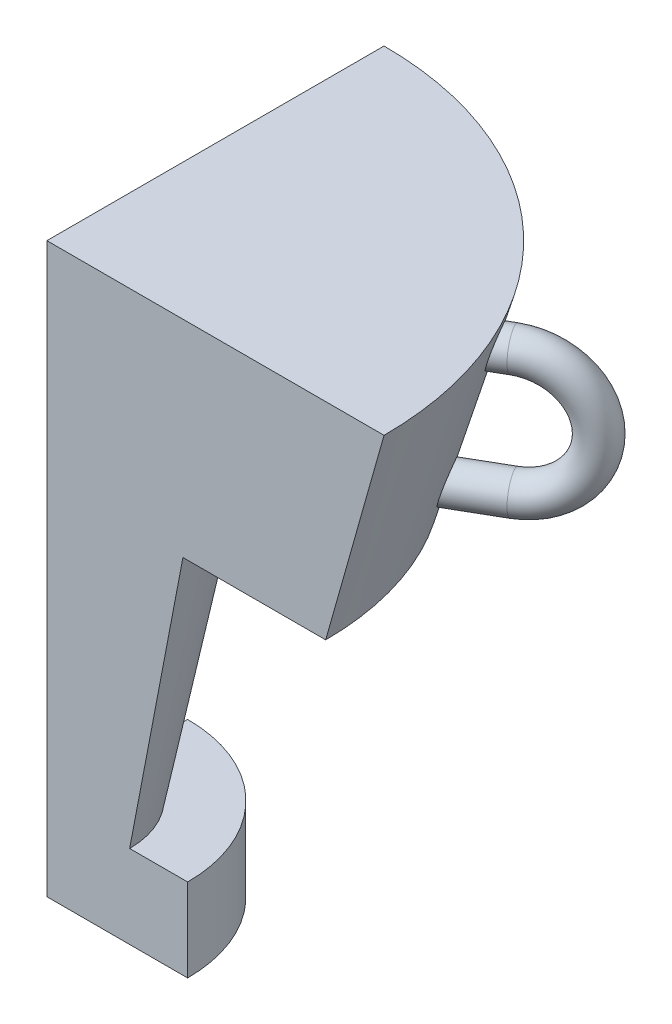
ISO-10303-21;
HEADER;
FILE_DESCRIPTION(('STEP AP214'),'2;1');
FILE_NAME('part.step','',(''),(''),'','','');
FILE_SCHEMA(('AUTOMOTIVE_DESIGN { 1 0 10303 214 1 1 1 1 }'));
ENDSEC;
DATA;
#1=APPLICATION_CONTEXT('core data for automotive mechanical design processes');
#2=APPLICATION_PROTOCOL_DEFINITION('international standard','automotive_design',2000,#1);
#3=PRODUCT_CONTEXT('',#1,'mechanical');
#4=PRODUCT('Part','Part','',(#3));
#5=PRODUCT_RELATED_PRODUCT_CATEGORY('part','',(#4));
#6=PRODUCT_DEFINITION_FORMATION('','',#4);
#7=PRODUCT_DEFINITION_CONTEXT('part definition',#1,'design');
#8=PRODUCT_DEFINITION('design','',#6,#7);
#9=PRODUCT_DEFINITION_SHAPE('','',#8);
#10=(LENGTH_UNIT() NAMED_UNIT(*) SI_UNIT(.MILLI.,.METRE.));
#11=(NAMED_UNIT(*) PLANE_ANGLE_UNIT() SI_UNIT($,.RADIAN.));
#12=(NAMED_UNIT(*) SI_UNIT($,.STERADIAN.) SOLID_ANGLE_UNIT());
#13=UNCERTAINTY_MEASURE_WITH_UNIT(LENGTH_MEASURE(1.E-05),#10,'distance_accuracy_value','');
#14=(GEOMETRIC_REPRESENTATION_CONTEXT(3) GLOBAL_UNCERTAINTY_ASSIGNED_CONTEXT((#13)) GLOBAL_UNIT_ASSIGNED_CONTEXT((#10,
#11,#12)) REPRESENTATION_CONTEXT('',''));
#15=CARTESIAN_POINT('',(0.,0.,0.));
#16=DIRECTION('',(0.,0.,1.));
#17=DIRECTION('',(1.,0.,0.));
#18=AXIS2_PLACEMENT_3D('',#15,#16,#17);
#19=CARTESIAN_POINT('',(0.,58.2177475068306,0.));
#20=DIRECTION('',(0.,1.,0.));
#21=DIRECTION('',(0.,0.,1.));
#22=AXIS2_PLACEMENT_3D('',#19,#20,#21);
#23=CONICAL_SURFACE('',#22,44.8585287538697,0.275531499985695);
#24=CARTESIAN_POINT('',(39.1671010335605,65.8671233205081,-26.0178692229212));
#25=CARTESIAN_POINT('',(39.1914989310226,66.0397011922566,-26.069322121599));
#26=CARTESIAN_POINT('',(39.2249538563284,66.2148418007009,-26.1084107848755));
#27=CARTESIAN_POINT('',(39.3089033734549,66.5650645452154,-26.160984951982));
#28=CARTESIAN_POINT('',(39.3594236959115,66.7401461909796,-26.1744315889588));
#29=CARTESIAN_POINT('',(39.4758506605663,67.0850345907476,-26.175366233325));
#30=CARTESIAN_POINT('',(39.5417437078308,67.2548458561595,-26.1628771004573));
#31=CARTESIAN_POINT('',(39.6869011566649,67.5845686648974,-26.1121414928916));
#32=CARTESIAN_POINT('',(39.7661617688715,67.7444829962392,-26.073902308507));
#33=CARTESIAN_POINT('',(39.9358514531515,68.0502536230801,-25.9721542327632));
#34=CARTESIAN_POINT('',(40.0263065547478,68.1960756952996,-25.9085856542641));
#35=CARTESIAN_POINT('',(40.2153845650959,68.4687144334742,-25.7573119933487));
#36=CARTESIAN_POINT('',(40.3140069029625,68.5955324260655,-25.6696085969484));
#37=CARTESIAN_POINT('',(40.5131619006659,68.8224421127021,-25.4748237824864));
#38=CARTESIAN_POINT('',(40.6135539527947,68.9232079374831,-25.3683853340513));
#39=CARTESIAN_POINT('',(40.8155484557288,69.099074140105,-25.1370425772179));
#40=CARTESIAN_POINT('',(40.9171504686911,69.1741835265842,-25.0121447724909));
#41=CARTESIAN_POINT('',(41.1128138695377,69.2926296841643,-24.754138325935));
#42=CARTESIAN_POINT('',(41.2069951973805,69.3373946019656,-24.6217759951853));
#43=CARTESIAN_POINT('',(41.390078138724,69.3993599318143,-24.3473172126038));
#44=CARTESIAN_POINT('',(41.4789812804019,69.4165683600543,-24.2052236041511));
#45=CARTESIAN_POINT('',(41.6451168357903,69.4226064766531,-23.9216373353984));
#46=CARTESIAN_POINT('',(41.722678983757,69.4125749686089,-23.7803606213448));
#47=CARTESIAN_POINT('',(41.8681291744688,69.3669336832163,-23.4969795706967));
#48=CARTESIAN_POINT('',(41.9360177880583,69.3313254159265,-23.3548752834536));
#49=CARTESIAN_POINT('',(42.0601958322347,69.2360536352629,-23.0745412824099));
#50=CARTESIAN_POINT('',(42.1165344562878,69.1764954839087,-22.9362973979969));
#51=CARTESIAN_POINT('',(42.2169132164677,69.0353592713694,-22.6667801712794));
#52=CARTESIAN_POINT('',(42.2609517234207,68.9537782960313,-22.5355077542219));
#53=CARTESIAN_POINT('',(42.3374099423772,68.768068791168,-22.2790382462474));
#54=CARTESIAN_POINT('',(42.3693916882053,68.6632772770249,-22.154191299572));
#55=CARTESIAN_POINT('',(42.4194298350932,68.4360104146723,-21.9186125051759));
#56=CARTESIAN_POINT('',(42.4374829595154,68.3135309134937,-21.8078839838538));
#57=CARTESIAN_POINT('',(42.460382949758,68.0476699257239,-21.5980008462979));
#58=CARTESIAN_POINT('',(42.4645209142665,67.9035475535473,-21.499706964187));
#59=CARTESIAN_POINT('',(42.4580727994018,67.6033824327313,-21.3240182930077));
#60=CARTESIAN_POINT('',(42.4474834306038,67.4473370283797,-21.2466281775131));
#61=CARTESIAN_POINT('',(42.4115320652216,67.1210625303278,-21.1121151457559));
#62=CARTESIAN_POINT('',(42.3856059097142,66.9505170351099,-21.0559081638438));
#63=CARTESIAN_POINT('',(42.3194403808798,66.6055815377562,-20.9698474276342));
#64=CARTESIAN_POINT('',(42.2791996737429,66.4311911787823,-20.9399961300256));
#65=CARTESIAN_POINT('',(42.1850057157782,66.0817134852005,-20.907554713036));
#66=CARTESIAN_POINT('',(42.130922514528,65.9066359494882,-20.9052333969629));
#67=CARTESIAN_POINT('',(42.0105378076065,65.5626967933735,-20.9289458027202));
#68=CARTESIAN_POINT('',(41.9442373226035,65.3938346551311,-20.9549771567755));
#69=CARTESIAN_POINT('',(41.8023272368674,65.0707075202366,-21.0341827313516));
#70=CARTESIAN_POINT('',(41.7269178299506,64.9162265622365,-21.0868333003964));
#71=CARTESIAN_POINT('',(41.5675764906808,64.6232971757318,-21.2176748624636));
#72=CARTESIAN_POINT('',(41.4836460612476,64.4848459291292,-21.2958613568881));
#73=CARTESIAN_POINT('',(41.3120733820679,64.232709058442,-21.4726623419228));
#74=CARTESIAN_POINT('',(41.2246322884663,64.118378998334,-21.5705530846745));
#75=CARTESIAN_POINT('',(41.0458171255342,63.9129365121929,-21.7852790444689));
#76=CARTESIAN_POINT('',(40.9544437037785,63.8218202802852,-21.9021111509556));
#77=CARTESIAN_POINT('',(40.7727244774274,63.668100426382,-22.1476317504466));
#78=CARTESIAN_POINT('',(40.6824212143402,63.6047717334684,-22.2758981187463));
#79=CARTESIAN_POINT('',(40.5027169169997,63.5050885149121,-22.5431001435939));
#80=CARTESIAN_POINT('',(40.4133157891249,63.4687311612522,-22.6820346798695));
#81=CARTESIAN_POINT('',(40.2393756779962,63.4245780551826,-22.9640077923874));
#82=CARTESIAN_POINT('',(40.1547802464572,63.4163127760124,-23.1069382228393));
#83=CARTESIAN_POINT('',(39.9912543241001,63.4272943888467,-23.3949615762297));
#84=CARTESIAN_POINT('',(39.9123235809507,63.4465400545881,-23.540054402497));
#85=CARTESIAN_POINT('',(39.7628337672628,63.5117527844297,-23.8275793861095));
#86=CARTESIAN_POINT('',(39.6922352268178,63.5575872332232,-23.9700211528401));
#87=CARTESIAN_POINT('',(39.5611044369885,63.6744034982044,-24.2490901978797));
#88=CARTESIAN_POINT('',(39.500571838393,63.7453844417337,-24.3857176777774));
#89=CARTESIAN_POINT('',(39.3911163529904,63.9107667911917,-24.6503939315317));
#90=CARTESIAN_POINT('',(39.3422671703607,64.0053095755823,-24.7783847663336));
#91=CARTESIAN_POINT('',(39.2582036299526,64.2146802316126,-25.0216662051318));
#92=CARTESIAN_POINT('',(39.2229935354588,64.3295144296033,-25.1369528300221));
#93=CARTESIAN_POINT('',(39.1668360815986,64.5782110472281,-25.3539970690719));
#94=CARTESIAN_POINT('',(39.1461577051191,64.7123795790806,-25.4554728453559));
#95=CARTESIAN_POINT('',(39.1207849703586,64.9940451341814,-25.6400126469785));
#96=CARTESIAN_POINT('',(39.1160738884693,65.1415280460234,-25.7230958507506));
#97=CARTESIAN_POINT('',(39.1214082715991,65.3863419024877,-25.8407339020377));
#98=CARTESIAN_POINT('',(39.1264224283009,65.4808419839619,-25.8815883748012));
#99=CARTESIAN_POINT('',(39.1423550310844,65.6723281053095,-25.9555754355012));
#100=CARTESIAN_POINT('',(39.1532734280208,65.7693141244842,-25.9887080877086));
#101=CARTESIAN_POINT('',(39.1671010335605,65.8671233205081,-26.0178692229212));
#102=B_SPLINE_CURVE_WITH_KNOTS('',3,(#24,#25,#26,#27,#28,#29,#30,#31,#32,#33,#34,#35,#36,#37,
#38,#39,#40,#41,#42,#43,#44,#45,#46,#47,#48,#49,#50,#51,#52,#53,#54,#55,#56,#57,#58,#59,#60,#61,
#62,#63,#64,#65,#66,#67,#68,#69,#70,#71,#72,#73,#74,#75,#76,#77,#78,#79,#80,#81,#82,#83,#84,#85,
#86,#87,#88,#89,#90,#91,#92,#93,#94,#95,#96,#97,#98,#99,#100,#101),.UNSPECIFIED.,.T.,.F.,(4,2,2,
2,2,2,2,2,2,2,2,2,2,2,2,2,2,2,2,2,2,2,2,2,2,2,2,2,2,2,2,2,2,2,2,2,2,2,4),(0.,0.544808228279566,
1.09044159425492,1.63559424404491,2.18059261594542,2.72688291030701,3.27313505147169,
3.80338420836936,4.33344698924736,4.83640832876263,5.33922333005113,5.82134454996533,
6.30343730765606,6.78343201406199,7.26349026655374,7.75960787458836,8.25584215621541,
8.77700235038089,9.29827896702593,9.84003987851123,10.3818512837523,10.928948640377,
11.4760003115641,12.0126863992437,12.5492779912759,13.0689101317555,13.5884570243754,
14.0934975831574,14.5984851795956,15.0949898459015,15.5914723818742,16.0854996756099,
16.5795098268037,17.0765587384568,17.5737628917376,18.0799437878938,18.5855943630692,
18.8943691660066,19.2031413988272),.UNSPECIFIED.);
#103=CARTESIAN_POINT('',(39.1671010335605,65.8671233205081,-26.0178692229212));
#104=VERTEX_POINT('',#103);
#105=EDGE_CURVE('E112',#104,#104,#102,.T.);
#106=ORIENTED_EDGE('',*,*,#105,.F.);
#107=EDGE_LOOP('',(#106));
#108=FACE_BOUND('',#107,.T.);
#109=CARTESIAN_POINT('',(0.,58.2177475068306,0.));
#110=DIRECTION('',(0.,-1.,0.));
#111=DIRECTION('',(0.,0.,-1.));
#112=AXIS2_PLACEMENT_3D('',#109,#110,#111);
#113=CIRCLE('',#112,44.8585287538697);
#114=CARTESIAN_POINT('',(-1.56622716032094E-13,58.2177475068306,-44.8585287538697));
#115=VERTEX_POINT('',#114);
#116=CARTESIAN_POINT('',(44.8585287538697,58.2177475068306,0.));
#117=VERTEX_POINT('',#116);
#118=EDGE_CURVE('E43',#115,#117,#113,.T.);
#119=ORIENTED_EDGE('',*,*,#118,.F.);
#120=DIRECTION('',(0.,0.962280734503106,-0.272058427555851));
#121=VECTOR('',#120,1.);
#122=CARTESIAN_POINT('',(-1.89397490318464E-13,91.42015625,-54.2455971943469));
#123=LINE('',#122,#121);
#124=CARTESIAN_POINT('',(-1.89397490318464E-13,91.42015625,-54.2455971943469));
#125=VERTEX_POINT('',#124);
#126=EDGE_CURVE('E145',#115,#125,#123,.T.);
#127=ORIENTED_EDGE('',*,*,#126,.T.);
#128=CARTESIAN_POINT('',(0.,91.42015625,0.));
#129=DIRECTION('',(0.,-1.,0.));
#130=DIRECTION('',(0.,0.,-1.));
#131=AXIS2_PLACEMENT_3D('',#128,#129,#130);
#132=CIRCLE('',#131,54.2455971943469);
#133=CARTESIAN_POINT('',(54.2455971943469,91.42015625,0.));
#134=VERTEX_POINT('',#133);
#135=EDGE_CURVE('E11',#125,#134,#132,.T.);
#136=ORIENTED_EDGE('',*,*,#135,.T.);
#137=DIRECTION('',(0.272058427555851,0.962280734503106,0.));
#138=VECTOR('',#137,1.);
#139=CARTESIAN_POINT('',(54.2455971943469,91.42015625,0.));
#140=LINE('',#139,#138);
#141=EDGE_CURVE('E130',#117,#134,#140,.T.);
#142=ORIENTED_EDGE('',*,*,#141,.F.);
#143=EDGE_LOOP('',(#119,#127,#136,#142));
#144=FACE_BOUND('',#143,.T.);
#145=CARTESIAN_POINT('',(44.0581739593476,84.6679821663623,-28.2488511237492));
#146=CARTESIAN_POINT('',(44.0379820981382,84.8085548461668,-28.3539759716128));
#147=CARTESIAN_POINT('',(44.0263371886653,84.9575907799101,-28.4496824018898));
#148=CARTESIAN_POINT('',(44.0205636319524,85.2678284829585,-28.6198518891623));
#149=CARTESIAN_POINT('',(44.0264626906619,85.42904910302,-28.6942811412518));
#150=CARTESIAN_POINT('',(44.055562821389,85.7584394207422,-28.8200474490074));
#151=CARTESIAN_POINT('',(44.0787333173609,85.9265963425291,-28.8714250563867));
#152=CARTESIAN_POINT('',(44.1415888252501,86.2653426809597,-28.9502342522308));
#153=CARTESIAN_POINT('',(44.1812697468641,86.4359314850257,-28.9776717664191));
#154=CARTESIAN_POINT('',(44.2770008280203,86.7787746941792,-29.0084380502869));
#155=CARTESIAN_POINT('',(44.333392978293,86.9509827479395,-29.0112212896144));
#156=CARTESIAN_POINT('',(44.4604923209155,87.2885130976398,-28.9911412163301));
#157=CARTESIAN_POINT('',(44.5312019498173,87.4538342157776,-28.9682735354273));
#158=CARTESIAN_POINT('',(44.6856545277759,87.7746768361448,-28.8968360417936));
#159=CARTESIAN_POINT('',(44.769527679732,87.9300758931479,-28.8479963675974));
#160=CARTESIAN_POINT('',(44.947179715076,88.2244960042421,-28.7252823127178));
#161=CARTESIAN_POINT('',(45.0409579913134,88.3635180610844,-28.651409465871));
#162=CARTESIAN_POINT('',(45.2334542266272,88.6180873440847,-28.4818232322879));
#163=CARTESIAN_POINT('',(45.3320342626978,88.7340517817443,-28.3865808151701));
#164=CARTESIAN_POINT('',(45.5325933851368,88.9419137968691,-28.1755929581911));
#165=CARTESIAN_POINT('',(45.6345714524729,89.0338185176441,-28.0598536209964));
#166=CARTESIAN_POINT('',(45.8336495044045,89.1864226274192,-27.8166890656628));
#167=CARTESIAN_POINT('',(45.9307566559376,89.2483702002644,-27.6900534003084));
#168=CARTESIAN_POINT('',(46.1215900852474,89.344789574479,-27.4243870796131));
#169=CARTESIAN_POINT('',(46.2153174358564,89.3792701691637,-27.285360407007));
#170=CARTESIAN_POINT('',(46.392063685305,89.4184406524935,-27.0057246852881));
#171=CARTESIAN_POINT('',(46.475376715575,89.4244262944088,-26.8654817111521));
#172=CARTESIAN_POINT('',(46.6335617828831,89.4099030727041,-26.5816632788819));
#173=CARTESIAN_POINT('',(46.7084348922528,89.3893975790416,-26.4380882469028));
#174=CARTESIAN_POINT('',(46.846570167106,89.3232206573937,-26.1541681396446));
#175=CARTESIAN_POINT('',(46.9099999628087,89.2779600022078,-26.0138082935936));
#176=CARTESIAN_POINT('',(47.0252855954878,89.1641563832438,-25.7378749213419));
#177=CARTESIAN_POINT('',(47.0771405178695,89.095611580735,-25.6023017740767));
#178=CARTESIAN_POINT('',(47.1693886322669,88.935694274909,-25.3365554496243));
#179=CARTESIAN_POINT('',(47.2094977329568,88.8438429194906,-25.2065723646857));
#180=CARTESIAN_POINT('',(47.2761901741322,88.6409865104394,-24.9586562302565));
#181=CARTESIAN_POINT('',(47.3027707096301,88.5299774910762,-24.8407256837644));
#182=CARTESIAN_POINT('',(47.3432401011242,88.2863975418912,-24.6145994354291));
#183=CARTESIAN_POINT('',(47.3564840110258,88.1530660107785,-24.5071077281584));
#184=CARTESIAN_POINT('',(47.3683217216514,87.872569818826,-24.311030628084));
#185=CARTESIAN_POINT('',(47.3669120993545,87.7254019338119,-24.2224496577036));
#186=CARTESIAN_POINT('',(47.3495453659179,87.4143014758292,-24.0628669718373));
#187=CARTESIAN_POINT('',(47.3329462184954,87.2499149526464,-23.9928184717821));
#188=CARTESIAN_POINT('',(47.2850436779012,86.9146906038828,-23.8775619856963));
#189=CARTESIAN_POINT('',(47.2537381498202,86.7438518449505,-23.8323576083282));
#190=CARTESIAN_POINT('',(47.1765666926288,86.396827207127,-23.7674868141646));
#191=CARTESIAN_POINT('',(47.1304178853865,86.2206032069194,-23.7483578637552));
#192=CARTESIAN_POINT('',(47.0249483363418,85.8712974034655,-23.738173839959));
#193=CARTESIAN_POINT('',(46.9656278772779,85.6982155328574,-23.7471181640142));
#194=CARTESIAN_POINT('',(46.8358707854488,85.3620614390222,-23.7929116774699));
#195=CARTESIAN_POINT('',(46.7655492106005,85.1989075167047,-23.8294855746313));
#196=CARTESIAN_POINT('',(46.6150273311449,84.8858998082075,-23.9294466570627));
#197=CARTESIAN_POINT('',(46.5348285608372,84.7360439625434,-23.9928296815816));
#198=CARTESIAN_POINT('',(46.3689505669664,84.4586734770247,-24.1425064839343));
#199=CARTESIAN_POINT('',(46.2834967535389,84.3306382803324,-24.2280850919488));
#200=CARTESIAN_POINT('',(46.1072168319155,84.0960285077893,-24.4204988271015));
#201=CARTESIAN_POINT('',(46.0163916785158,83.9894501325718,-24.5273301843359));
#202=CARTESIAN_POINT('',(45.8346100640272,83.8043379743923,-24.755405453767));
#203=CARTESIAN_POINT('',(45.7437448847417,83.7250374977136,-24.876100173631));
#204=CARTESIAN_POINT('',(45.5615747503774,83.5926774235931,-25.1308124036325));
#205=CARTESIAN_POINT('',(45.470269854989,83.5396143605346,-25.2648281514277));
#206=CARTESIAN_POINT('',(45.2917264246587,83.4623881050621,-25.53907443399));
#207=CARTESIAN_POINT('',(45.2044426292421,83.4376182449983,-25.6791049486973));
#208=CARTESIAN_POINT('',(45.034308436202,83.4157235234948,-25.9639269235018));
#209=CARTESIAN_POINT('',(44.9514575407248,83.4185955510464,-26.1087178460021));
#210=CARTESIAN_POINT('',(44.7933463900371,83.4517237472582,-26.3975030946974));
#211=CARTESIAN_POINT('',(44.7180218671649,83.4817211757301,-26.5414920394771));
#212=CARTESIAN_POINT('',(44.5762859054312,83.5677803219905,-26.8260716396044));
#213=CARTESIAN_POINT('',(44.5098766840088,83.6238485087508,-26.9666614424049));
#214=CARTESIAN_POINT('',(44.3877740454609,83.7604985991944,-27.2411148124459));
#215=CARTESIAN_POINT('',(44.3321218010122,83.8411717580134,-27.3749511414209));
#216=CARTESIAN_POINT('',(44.2335973394778,84.0243650380725,-27.6317505634122));
#217=CARTESIAN_POINT('',(44.1907101292782,84.1268592846912,-27.7547262922898));
#218=CARTESIAN_POINT('',(44.133792219063,84.3042372517035,-27.9388533550096));
#219=CARTESIAN_POINT('',(44.1151590677157,84.3730412674305,-28.0045619609291));
#220=CARTESIAN_POINT('',(44.0828855299687,84.5163762421691,-28.1307411444735));
#221=CARTESIAN_POINT('',(44.0692450273195,84.5909070677881,-28.1912118440333));
#222=CARTESIAN_POINT('',(44.0581739593476,84.6679821663623,-28.2488511237492));
#223=B_SPLINE_CURVE_WITH_KNOTS('',3,(#145,#146,#147,#148,#149,#150,#151,#152,#153,#154,#155,
#156,#157,#158,#159,#160,#161,#162,#163,#164,#165,#166,#167,#168,#169,#170,#171,#172,#173,#174,
#175,#176,#177,#178,#179,#180,#181,#182,#183,#184,#185,#186,#187,#188,#189,#190,#191,#192,#193,
#194,#195,#196,#197,#198,#199,#200,#201,#202,#203,#204,#205,#206,#207,#208,#209,#210,#211,#212,
#213,#214,#215,#216,#217,#218,#219,#220,#221,#222),.UNSPECIFIED.,.T.,.F.,(4,2,2,2,2,2,2,2,2,2,2,
2,2,2,2,2,2,2,2,2,2,2,2,2,2,2,2,2,2,2,2,2,2,2,2,2,2,2,4),(0.,0.529706288262328,1.06024954822157,
1.58985579857403,2.11933092198273,2.66049335894585,3.20174796858448,3.74873962554422,
4.29569777320184,4.83161513007574,5.36737319261773,5.87831639723041,6.38909596198468,
6.87641148455568,7.36366502145165,7.84306838006781,8.32250960559282,8.81273655008293,
9.30306509594732,9.81610688421707,10.3292685201967,10.8651756305653,11.4011605620404,
11.9480341626055,12.4948960252869,13.0363798378977,13.5777796435534,14.1035307352219,
14.6291886499303,15.1385577117867,15.6478594747146,16.1460226667196,16.6441297926568,
17.1375351874406,17.6310630769454,18.1264440959045,18.6212409501854,18.9116822731108,
19.2021168329408),.UNSPECIFIED.);
#224=CARTESIAN_POINT('',(44.0581739593476,84.6679821663623,-28.2488511237492));
#225=VERTEX_POINT('',#224);
#226=EDGE_CURVE('E199',#225,#225,#223,.T.);
#227=ORIENTED_EDGE('',*,*,#226,.F.);
#228=EDGE_LOOP('',(#227));
#229=FACE_BOUND('',#228,.T.);
#230=ADVANCED_FACE('F35',(#108,#144,#229),#23,.T.);
#231=CARTESIAN_POINT('',(0.,0.,-22.6477326110135));
#232=DIRECTION('',(0.,-1.,0.));
#233=DIRECTION('',(0.,0.,-1.));
#234=AXIS2_PLACEMENT_3D('',#231,#232,#233);
#235=PLANE('',#234);
#236=DIRECTION('',(1.,0.,0.));
#237=VECTOR('',#236,1.);
#238=CARTESIAN_POINT('',(22.6477326110135,0.,0.));
#239=LINE('',#238,#237);
#240=CARTESIAN_POINT('',(0.,0.,0.));
#241=VERTEX_POINT('',#240);
#242=CARTESIAN_POINT('',(22.6477326110135,0.,0.));
#243=VERTEX_POINT('',#242);
#244=EDGE_CURVE('E50',#241,#243,#239,.T.);
#245=ORIENTED_EDGE('',*,*,#244,.F.);
#246=DIRECTION('',(0.,0.,-1.));
#247=VECTOR('',#246,1.);
#248=CARTESIAN_POINT('',(0.,0.,-22.6477326110135));
#249=LINE('',#248,#247);
#250=CARTESIAN_POINT('',(0.,0.,-22.6477326110135));
#251=VERTEX_POINT('',#250);
#252=EDGE_CURVE('E96',#241,#251,#249,.T.);
#253=ORIENTED_EDGE('',*,*,#252,.T.);
#254=CARTESIAN_POINT('',(0.,0.,0.));
#255=DIRECTION('',(0.,-1.,0.));
#256=DIRECTION('',(0.,0.,-1.));
#257=AXIS2_PLACEMENT_3D('',#254,#255,#256);
#258=CIRCLE('',#257,22.6477326110135);
#259=EDGE_CURVE('E92',#251,#243,#258,.T.);
#260=ORIENTED_EDGE('',*,*,#259,.T.);
#261=EDGE_LOOP('',(#245,#253,#260));
#262=FACE_BOUND('',#261,.T.);
#263=ADVANCED_FACE('F94',(#262),#235,.T.);
#264=CARTESIAN_POINT('',(0.,91.42015625,0.));
#265=DIRECTION('',(0.,1.,0.));
#266=DIRECTION('',(0.,0.,1.));
#267=AXIS2_PLACEMENT_3D('',#264,#265,#266);
#268=PLANE('',#267);
#269=ORIENTED_EDGE('',*,*,#135,.F.);
#270=DIRECTION('',(0.,0.,1.));
#271=VECTOR('',#270,1.);
#272=CARTESIAN_POINT('',(0.,91.42015625,0.));
#273=LINE('',#272,#271);
#274=CARTESIAN_POINT('',(0.,91.42015625,0.));
#275=VERTEX_POINT('',#274);
#276=EDGE_CURVE('E148',#125,#275,#273,.T.);
#277=ORIENTED_EDGE('',*,*,#276,.T.);
#278=DIRECTION('',(-1.,0.,0.));
#279=VECTOR('',#278,1.);
#280=CARTESIAN_POINT('',(0.,91.42015625,0.));
#281=LINE('',#280,#279);
#282=EDGE_CURVE('E57',#134,#275,#281,.T.);
#283=ORIENTED_EDGE('',*,*,#282,.F.);
#284=EDGE_LOOP('',(#269,#277,#283));
#285=FACE_BOUND('',#284,.T.);
#286=ADVANCED_FACE('F37',(#285),#268,.T.);
#287=CARTESIAN_POINT('',(-1.56622716032094E-13,58.2177475068306,-44.8585287538697));
#288=DIRECTION('',(0.,-1.,0.));
#289=DIRECTION('',(0.,0.,-1.));
#290=AXIS2_PLACEMENT_3D('',#287,#288,#289);
#291=PLANE('',#290);
#292=CARTESIAN_POINT('',(0.,58.2177475068306,0.));
#293=DIRECTION('',(0.,-1.,0.));
#294=DIRECTION('',(0.,0.,-1.));
#295=AXIS2_PLACEMENT_3D('',#292,#293,#294);
#296=CIRCLE('',#295,21.8881864493028);
#297=CARTESIAN_POINT('',(0.,58.2177475068306,-21.8881864493028));
#298=VERTEX_POINT('',#297);
#299=CARTESIAN_POINT('',(21.8881864493028,58.2177475068306,0.));
#300=VERTEX_POINT('',#299);
#301=EDGE_CURVE('E154',#298,#300,#296,.T.);
#302=ORIENTED_EDGE('',*,*,#301,.F.);
#303=DIRECTION('',(0.,0.,-1.));
#304=VECTOR('',#303,1.);
#305=CARTESIAN_POINT('',(-1.56622716032094E-13,58.2177475068306,-44.8585287538697));
#306=LINE('',#305,#304);
#307=EDGE_CURVE('E142',#298,#115,#306,.T.);
#308=ORIENTED_EDGE('',*,*,#307,.T.);
#309=ORIENTED_EDGE('',*,*,#118,.T.);
#310=DIRECTION('',(1.,0.,0.));
#311=VECTOR('',#310,1.);
#312=CARTESIAN_POINT('',(44.8585287538697,58.2177475068306,0.));
#313=LINE('',#312,#311);
#314=EDGE_CURVE('E127',#300,#117,#313,.T.);
#315=ORIENTED_EDGE('',*,*,#314,.F.);
#316=EDGE_LOOP('',(#302,#308,#309,#315));
#317=FACE_BOUND('',#316,.T.);
#318=ADVANCED_FACE('F157',(#317),#291,.T.);
#319=CARTESIAN_POINT('',(0.,13.3813020833333,0.));
#320=DIRECTION('',(0.,1.,0.));
#321=DIRECTION('',(0.,0.,1.));
#322=AXIS2_PLACEMENT_3D('',#319,#320,#321);
#323=CONICAL_SURFACE('',#322,13.3145555276802,0.188939300508649);
#324=CARTESIAN_POINT('',(0.,13.3813020833333,0.));
#325=DIRECTION('',(0.,-1.,0.));
#326=DIRECTION('',(0.,0.,-1.));
#327=AXIS2_PLACEMENT_3D('',#324,#325,#326);
#328=CIRCLE('',#327,13.3145555276802);
#329=CARTESIAN_POINT('',(0.,13.3813020833333,-13.3145555276802));
#330=VERTEX_POINT('',#329);
#331=CARTESIAN_POINT('',(13.3145555276802,13.3813020833333,0.));
#332=VERTEX_POINT('',#331);
#333=EDGE_CURVE('E152',#330,#332,#328,.T.);
#334=ORIENTED_EDGE('',*,*,#333,.F.);
#335=DIRECTION('',(0.,0.98220400519526,-0.187817177538129));
#336=VECTOR('',#335,1.);
#337=CARTESIAN_POINT('',(0.,58.2177475068306,-21.8881864493028));
#338=LINE('',#337,#336);
#339=EDGE_CURVE('E139',#330,#298,#338,.T.);
#340=ORIENTED_EDGE('',*,*,#339,.T.);
#341=ORIENTED_EDGE('',*,*,#301,.T.);
#342=DIRECTION('',(0.187817177538129,0.98220400519526,0.));
#343=VECTOR('',#342,1.);
#344=CARTESIAN_POINT('',(21.8881864493028,58.2177475068306,0.));
#345=LINE('',#344,#343);
#346=EDGE_CURVE('E124',#332,#300,#345,.T.);
#347=ORIENTED_EDGE('',*,*,#346,.F.);
#348=EDGE_LOOP('',(#334,#340,#341,#347));
#349=FACE_BOUND('',#348,.T.);
#350=ADVANCED_FACE('F173',(#349),#323,.T.);
#351=CARTESIAN_POINT('',(0.,13.3813020833333,-13.3145555276802));
#352=DIRECTION('',(0.,1.,0.));
#353=DIRECTION('',(0.,0.,1.));
#354=AXIS2_PLACEMENT_3D('',#351,#352,#353);
#355=PLANE('',#354);
#356=CARTESIAN_POINT('',(0.,13.3813020833333,0.));
#357=DIRECTION('',(0.,-1.,0.));
#358=DIRECTION('',(0.,0.,-1.));
#359=AXIS2_PLACEMENT_3D('',#356,#357,#358);
#360=CIRCLE('',#359,22.6477326110135);
#361=CARTESIAN_POINT('',(0.,13.3813020833333,-22.6477326110135));
#362=VERTEX_POINT('',#361);
#363=CARTESIAN_POINT('',(22.6477326110135,13.3813020833333,0.));
#364=VERTEX_POINT('',#363);
#365=EDGE_CURVE('E100',#362,#364,#360,.T.);
#366=ORIENTED_EDGE('',*,*,#365,.F.);
#367=DIRECTION('',(0.,0.,1.));
#368=VECTOR('',#367,1.);
#369=CARTESIAN_POINT('',(0.,13.3813020833333,-13.3145555276802));
#370=LINE('',#369,#368);
#371=EDGE_CURVE('E136',#362,#330,#370,.T.);
#372=ORIENTED_EDGE('',*,*,#371,.T.);
#373=ORIENTED_EDGE('',*,*,#333,.T.);
#374=DIRECTION('',(-1.,0.,0.));
#375=VECTOR('',#374,1.);
#376=CARTESIAN_POINT('',(13.3145555276802,13.3813020833333,0.));
#377=LINE('',#376,#375);
#378=EDGE_CURVE('E108',#364,#332,#377,.T.);
#379=ORIENTED_EDGE('',*,*,#378,.F.);
#380=EDGE_LOOP('',(#366,#372,#373,#379));
#381=FACE_BOUND('',#380,.T.);
#382=ADVANCED_FACE('F171',(#381),#355,.T.);
#383=CARTESIAN_POINT('',(0.,0.,0.));
#384=DIRECTION('',(0.,-1.,0.));
#385=DIRECTION('',(0.,0.,-1.));
#386=AXIS2_PLACEMENT_3D('',#383,#384,#385);
#387=CYLINDRICAL_SURFACE('',#386,22.6477326110135);
#388=DIRECTION('',(0.,1.,0.));
#389=VECTOR('',#388,1.);
#390=CARTESIAN_POINT('',(0.,13.3813020833333,-22.6477326110135));
#391=LINE('',#390,#389);
#392=EDGE_CURVE('E134',#251,#362,#391,.T.);
#393=ORIENTED_EDGE('',*,*,#392,.T.);
#394=ORIENTED_EDGE('',*,*,#365,.T.);
#395=DIRECTION('',(0.,1.,0.));
#396=VECTOR('',#395,1.);
#397=CARTESIAN_POINT('',(22.6477326110135,13.3813020833333,0.));
#398=LINE('',#397,#396);
#399=EDGE_CURVE('E104',#243,#364,#398,.T.);
#400=ORIENTED_EDGE('',*,*,#399,.F.);
#401=ORIENTED_EDGE('',*,*,#259,.F.);
#402=EDGE_LOOP('',(#393,#394,#400,#401));
#403=FACE_BOUND('',#402,.T.);
#404=ADVANCED_FACE('F105',(#403),#387,.T.);
#405=CARTESIAN_POINT('',(0.,0.,0.));
#406=DIRECTION('',(-1.,0.,0.));
#407=DIRECTION('',(0.,0.,1.));
#408=AXIS2_PLACEMENT_3D('',#405,#406,#407);
#409=PLANE('',#408);
#410=ORIENTED_EDGE('',*,*,#252,.F.);
#411=DIRECTION('',(0.,-1.,0.));
#412=VECTOR('',#411,1.);
#413=CARTESIAN_POINT('',(0.,0.,0.));
#414=LINE('',#413,#412);
#415=EDGE_CURVE('E101',#275,#241,#414,.T.);
#416=ORIENTED_EDGE('',*,*,#415,.F.);
#417=ORIENTED_EDGE('',*,*,#276,.F.);
#418=ORIENTED_EDGE('',*,*,#126,.F.);
#419=ORIENTED_EDGE('',*,*,#307,.F.);
#420=ORIENTED_EDGE('',*,*,#339,.F.);
#421=ORIENTED_EDGE('',*,*,#371,.F.);
#422=ORIENTED_EDGE('',*,*,#392,.F.);
#423=EDGE_LOOP('',(#410,#416,#417,#418,#419,#420,#421,#422));
#424=FACE_BOUND('',#423,.T.);
#425=ADVANCED_FACE('F167',(#424),#409,.T.);
#426=CARTESIAN_POINT('',(0.,0.,0.));
#427=DIRECTION('',(0.,0.,-1.));
#428=DIRECTION('',(-1.,0.,0.));
#429=AXIS2_PLACEMENT_3D('',#426,#427,#428);
#430=PLANE('',#429);
#431=ORIENTED_EDGE('',*,*,#244,.T.);
#432=ORIENTED_EDGE('',*,*,#399,.T.);
#433=ORIENTED_EDGE('',*,*,#378,.T.);
#434=ORIENTED_EDGE('',*,*,#346,.T.);
#435=ORIENTED_EDGE('',*,*,#314,.T.);
#436=ORIENTED_EDGE('',*,*,#141,.T.);
#437=ORIENTED_EDGE('',*,*,#282,.T.);
#438=ORIENTED_EDGE('',*,*,#415,.T.);
#439=EDGE_LOOP('',(#431,#432,#433,#434,#435,#436,#437,#438));
#440=FACE_BOUND('',#439,.T.);
#441=ADVANCED_FACE('F110',(#440),#430,.F.);
#442=CARTESIAN_POINT('',(-500001.5,66.4201562499293,288676.000620218));
#443=DIRECTION('',(0.866025403784438,0.,-0.500000000000001));
#444=DIRECTION('',(-0.500000000000001,0.,-0.866025403784438));
#445=AXIS2_PLACEMENT_3D('',#442,#443,#444);
#446=CYLINDRICAL_SURFACE('',#445,3.);
#447=ORIENTED_EDGE('',*,*,#105,.T.);
#448=EDGE_LOOP('',(#447));
#449=FACE_BOUND('',#448,.T.);
#450=CARTESIAN_POINT('',(47.6313972081441,66.42015625,-27.5000000000001));
#451=DIRECTION('',(0.866025403784438,0.,-0.500000000000001));
#452=DIRECTION('',(0.500000000000001,0.,0.866025403784438));
#453=AXIS2_PLACEMENT_3D('',#450,#451,#452);
#454=CIRCLE('',#453,3.);
#455=CARTESIAN_POINT('',(47.6313972081441,63.42015625,-27.5000000000001));
#456=VERTEX_POINT('',#455);
#457=EDGE_CURVE('E115',#456,#456,#454,.T.);
#458=ORIENTED_EDGE('',*,*,#457,.F.);
#459=EDGE_LOOP('',(#458));
#460=FACE_BOUND('',#459,.T.);
#461=ADVANCED_FACE('F190',(#449,#460),#446,.T.);
#462=CARTESIAN_POINT('',(47.6313972081441,76.42015625,-27.5000000000001));
#463=DIRECTION('',(-0.500000000000001,0.,-0.866025403784438));
#464=DIRECTION('',(-0.866025403784438,0.,0.500000000000001));
#465=AXIS2_PLACEMENT_3D('',#462,#463,#464);
#466=TOROIDAL_SURFACE('',#465,9.99999999999999,3.);
#467=CARTESIAN_POINT('',(47.6313972081441,86.42015625,-27.5000000000001));
#468=DIRECTION('',(-0.866025403784438,0.,0.500000000000001));
#469=DIRECTION('',(0.500000000000001,0.,0.866025403784438));
#470=AXIS2_PLACEMENT_3D('',#467,#468,#469);
#471=CIRCLE('',#470,3.);
#472=CARTESIAN_POINT('',(47.6313972081441,89.42015625,-27.5000000000001));
#473=VERTEX_POINT('',#472);
#474=EDGE_CURVE('E197',#473,#473,#471,.T.);
#475=CARTESIAN_POINT('',(47.6313972081441,76.42015625,-27.5000000000001));
#476=DIRECTION('',(-0.500000000000001,0.,-0.866025403784438));
#477=DIRECTION('',(-0.866025403784438,0.,0.500000000000001));
#478=AXIS2_PLACEMENT_3D('',#475,#476,#477);
#479=CIRCLE('',#478,13.);
#480=EDGE_CURVE('',#473,#456,#479,.T.);
#481=ORIENTED_EDGE('',*,*,#474,.F.);
#482=ORIENTED_EDGE('',*,*,#457,.T.);
#483=ORIENTED_EDGE('',*,*,#480,.T.);
#484=ORIENTED_EDGE('',*,*,#480,.F.);
#485=EDGE_LOOP('',(#481,#483,#482,#484));
#486=FACE_BOUND('',#485,.T.);
#487=ADVANCED_FACE('F193',(#486),#466,.T.);
#488=CARTESIAN_POINT('',(47.6313972081441,86.42015625,-27.5000000000001));
#489=DIRECTION('',(-0.866025403784438,0.,0.5));
#490=DIRECTION('',(0.5,0.,0.866025403784439));
#491=AXIS2_PLACEMENT_3D('',#488,#489,#490);
#492=CYLINDRICAL_SURFACE('',#491,3.);
#493=ORIENTED_EDGE('',*,*,#474,.T.);
#494=EDGE_LOOP('',(#493));
#495=FACE_BOUND('',#494,.T.);
#496=ORIENTED_EDGE('',*,*,#226,.T.);
#497=EDGE_LOOP('',(#496));
#498=FACE_BOUND('',#497,.T.);
#499=ADVANCED_FACE('F210',(#495,#498),#492,.T.);
#500=CLOSED_SHELL('',(#230,#263,#286,#318,#350,#382,#404,#425,#441,#461,#487,#499));
#501=MANIFOLD_SOLID_BREP('B2',#500);
#502=ADVANCED_BREP_SHAPE_REPRESENTATION('',(#18,#501),#14);
#503=SHAPE_DEFINITION_REPRESENTATION(#9,#502);
ENDSEC;
END-ISO-10303-21;
